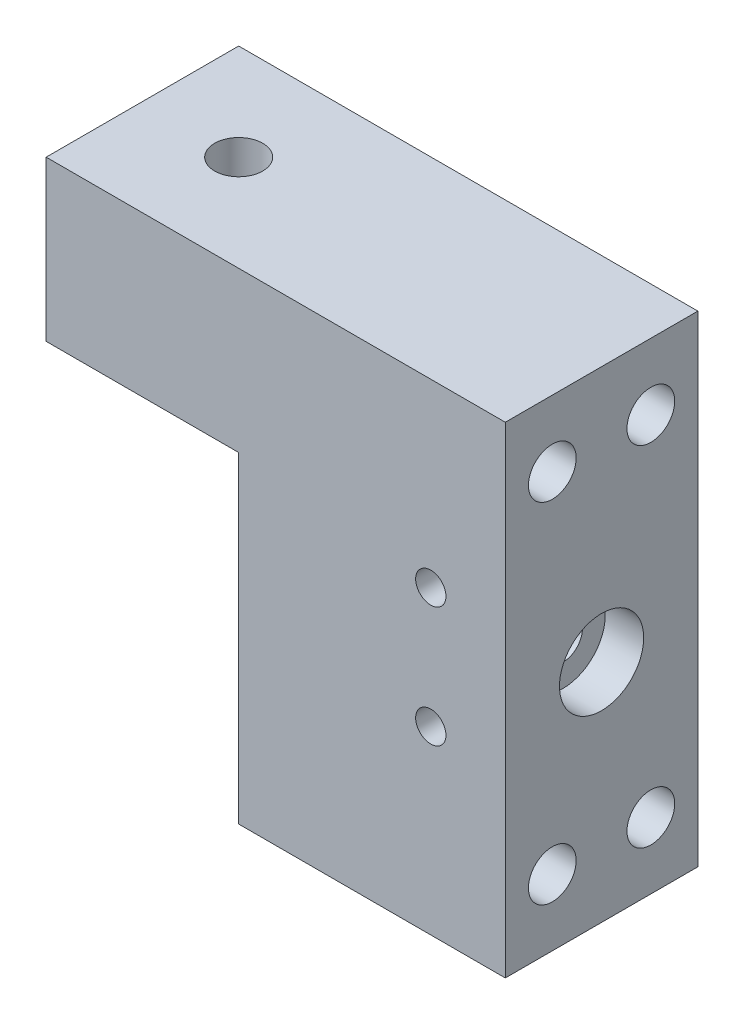
ISO-10303-21;
HEADER;
FILE_DESCRIPTION(('STEP AP214'),'2;1');
FILE_NAME('part.step','',(''),(''),'','','');
FILE_SCHEMA(('AUTOMOTIVE_DESIGN { 1 0 10303 214 1 1 1 1 }'));
ENDSEC;
DATA;
#1=APPLICATION_CONTEXT('core data for automotive mechanical design processes');
#2=APPLICATION_PROTOCOL_DEFINITION('international standard','automotive_design',2000,#1);
#3=PRODUCT_CONTEXT('',#1,'mechanical');
#4=PRODUCT('Part','Part','',(#3));
#5=PRODUCT_RELATED_PRODUCT_CATEGORY('part','',(#4));
#6=PRODUCT_DEFINITION_FORMATION('','',#4);
#7=PRODUCT_DEFINITION_CONTEXT('part definition',#1,'design');
#8=PRODUCT_DEFINITION('design','',#6,#7);
#9=PRODUCT_DEFINITION_SHAPE('','',#8);
#10=(LENGTH_UNIT() NAMED_UNIT(*) SI_UNIT(.MILLI.,.METRE.));
#11=(NAMED_UNIT(*) PLANE_ANGLE_UNIT() SI_UNIT($,.RADIAN.));
#12=(NAMED_UNIT(*) SI_UNIT($,.STERADIAN.) SOLID_ANGLE_UNIT());
#13=UNCERTAINTY_MEASURE_WITH_UNIT(LENGTH_MEASURE(1.E-05),#10,'distance_accuracy_value','');
#14=(GEOMETRIC_REPRESENTATION_CONTEXT(3) GLOBAL_UNCERTAINTY_ASSIGNED_CONTEXT((#13)) GLOBAL_UNIT_ASSIGNED_CONTEXT((#10,
#11,#12)) REPRESENTATION_CONTEXT('',''));
#15=CARTESIAN_POINT('',(0.,0.,0.));
#16=DIRECTION('',(0.,0.,1.));
#17=DIRECTION('',(1.,0.,0.));
#18=AXIS2_PLACEMENT_3D('',#15,#16,#17);
#19=CARTESIAN_POINT('',(-35.1759599997609,-372.311325805641,640.012630810973));
#20=DIRECTION('',(1.,2.16961551365428E-13,0.));
#21=DIRECTION('',(0.,0.,1.));
#22=AXIS2_PLACEMENT_3D('',#19,#20,#21);
#23=PLANE('',#22);
#24=CARTESIAN_POINT('',(-35.1759599997589,-381.861725805534,225.049350784979));
#25=DIRECTION('',(1.,2.16961551365428E-13,0.));
#26=DIRECTION('',(-2.16961551365428E-13,1.,0.));
#27=AXIS2_PLACEMENT_3D('',#24,#25,#26);
#28=CIRCLE('',#27,2.55270000000002);
#29=CARTESIAN_POINT('',(-35.1759599997595,-379.309025805534,225.049350784979));
#30=VERTEX_POINT('',#29);
#31=EDGE_CURVE('E118',#30,#30,#28,.T.);
#32=ORIENTED_EDGE('',*,*,#31,.T.);
#33=EDGE_LOOP('',(#32));
#34=FACE_BOUND('',#33,.T.);
#35=DIRECTION('',(0.,0.,1.));
#36=VECTOR('',#35,1.);
#37=CARTESIAN_POINT('',(-35.1759599998418,-369.161725805615,237.749350784974));
#38=LINE('',#37,#36);
#39=CARTESIAN_POINT('',(-35.1759599997617,-369.161725805615,212.349350784974));
#40=VERTEX_POINT('',#39);
#41=CARTESIAN_POINT('',(-35.1759599998418,-369.161725805615,237.749350784974));
#42=VERTEX_POINT('',#41);
#43=EDGE_CURVE('E49',#40,#42,#38,.T.);
#44=ORIENTED_EDGE('',*,*,#43,.F.);
#45=DIRECTION('',(2.16961551365428E-13,-1.,0.));
#46=VECTOR('',#45,1.);
#47=CARTESIAN_POINT('',(-35.1759599997662,-348.11172580558,212.349350784974));
#48=LINE('',#47,#46);
#49=CARTESIAN_POINT('',(-35.1759599997525,-411.611725805595,212.349350784974));
#50=VERTEX_POINT('',#49);
#51=EDGE_CURVE('E11',#40,#50,#48,.T.);
#52=ORIENTED_EDGE('',*,*,#51,.T.);
#53=DIRECTION('',(0.,0.,1.));
#54=VECTOR('',#53,1.);
#55=CARTESIAN_POINT('',(-35.1759599997525,-411.611725805595,212.349350784974));
#56=LINE('',#55,#54);
#57=CARTESIAN_POINT('',(-35.1759599997525,-411.611725805594,237.749350784974));
#58=VERTEX_POINT('',#57);
#59=EDGE_CURVE('E42',#50,#58,#56,.T.);
#60=ORIENTED_EDGE('',*,*,#59,.T.);
#61=DIRECTION('',(-2.16961551365428E-13,1.,0.));
#62=VECTOR('',#61,1.);
#63=CARTESIAN_POINT('',(-35.1759599997662,-348.11172580558,237.749350784974));
#64=LINE('',#63,#62);
#65=EDGE_CURVE('E172',#58,#42,#64,.T.);
#66=ORIENTED_EDGE('',*,*,#65,.T.);
#67=EDGE_LOOP('',(#44,#52,#60,#66));
#68=FACE_BOUND('',#67,.T.);
#69=ADVANCED_FACE('F33',(#34,#68),#23,.F.);
#70=CARTESIAN_POINT('',(-103.567553050368,-348.111725805595,212.349350784974));
#71=DIRECTION('',(0.,0.,-1.));
#72=DIRECTION('',(-1.,0.,0.));
#73=AXIS2_PLACEMENT_3D('',#70,#71,#72);
#74=PLANE('',#73);
#75=ORIENTED_EDGE('',*,*,#51,.F.);
#76=DIRECTION('',(1.,0.,0.));
#77=VECTOR('',#76,1.);
#78=CARTESIAN_POINT('',(-60.5759599998418,-369.161725805615,212.349350784974));
#79=LINE('',#78,#77);
#80=CARTESIAN_POINT('',(-60.5759599998418,-369.161725805615,212.349350784974));
#81=VERTEX_POINT('',#80);
#82=EDGE_CURVE('E168',#81,#40,#79,.T.);
#83=ORIENTED_EDGE('',*,*,#82,.F.);
#84=DIRECTION('',(0.,-1.,0.));
#85=VECTOR('',#84,1.);
#86=CARTESIAN_POINT('',(-60.5759599998418,-348.111725805595,212.349350784974));
#87=LINE('',#86,#85);
#88=CARTESIAN_POINT('',(-60.5759599998418,-348.111725805595,212.349350784974));
#89=VERTEX_POINT('',#88);
#90=EDGE_CURVE('E160',#89,#81,#87,.T.);
#91=ORIENTED_EDGE('',*,*,#90,.F.);
#92=DIRECTION('',(1.,0.,0.));
#93=VECTOR('',#92,1.);
#94=CARTESIAN_POINT('',(-103.567553050368,-348.111725805595,212.349350784974));
#95=LINE('',#94,#93);
#96=CARTESIAN_POINT('',(0.,-348.111725805595,212.349350784974));
#97=VERTEX_POINT('',#96);
#98=EDGE_CURVE('E37',#89,#97,#95,.T.);
#99=ORIENTED_EDGE('',*,*,#98,.T.);
#100=DIRECTION('',(0.,1.,0.));
#101=VECTOR('',#100,1.);
#102=CARTESIAN_POINT('',(0.,-348.111725805595,212.349350784974));
#103=LINE('',#102,#101);
#104=CARTESIAN_POINT('',(0.,-411.611725805595,212.349350784974));
#105=VERTEX_POINT('',#104);
#106=EDGE_CURVE('E171',#105,#97,#103,.T.);
#107=ORIENTED_EDGE('',*,*,#106,.F.);
#108=DIRECTION('',(1.,0.,0.));
#109=VECTOR('',#108,1.);
#110=CARTESIAN_POINT('',(-103.567553050368,-411.611725805595,212.349350784974));
#111=LINE('',#110,#109);
#112=EDGE_CURVE('E174',#50,#105,#111,.T.);
#113=ORIENTED_EDGE('',*,*,#112,.F.);
#114=EDGE_LOOP('',(#75,#83,#91,#99,#107,#113));
#115=FACE_BOUND('',#114,.T.);
#116=ADVANCED_FACE('F35',(#115),#74,.T.);
#117=CARTESIAN_POINT('',(-103.567553050368,-411.611725805595,212.349350784974));
#118=DIRECTION('',(0.,-1.,0.));
#119=DIRECTION('',(0.,0.,-1.));
#120=AXIS2_PLACEMENT_3D('',#117,#118,#119);
#121=PLANE('',#120);
#122=ORIENTED_EDGE('',*,*,#59,.F.);
#123=ORIENTED_EDGE('',*,*,#112,.T.);
#124=DIRECTION('',(0.,0.,-1.));
#125=VECTOR('',#124,1.);
#126=CARTESIAN_POINT('',(0.,-411.611725805595,212.349350784974));
#127=LINE('',#126,#125);
#128=CARTESIAN_POINT('',(0.,-411.611725805595,237.749350784974));
#129=VERTEX_POINT('',#128);
#130=EDGE_CURVE('E184',#129,#105,#127,.T.);
#131=ORIENTED_EDGE('',*,*,#130,.F.);
#132=DIRECTION('',(1.,0.,0.));
#133=VECTOR('',#132,1.);
#134=CARTESIAN_POINT('',(-103.567553050368,-411.611725805595,237.749350784974));
#135=LINE('',#134,#133);
#136=EDGE_CURVE('E188',#58,#129,#135,.T.);
#137=ORIENTED_EDGE('',*,*,#136,.F.);
#138=EDGE_LOOP('',(#122,#123,#131,#137));
#139=FACE_BOUND('',#138,.T.);
#140=ADVANCED_FACE('F205',(#139),#121,.T.);
#141=CARTESIAN_POINT('',(-103.567553050368,-348.111725805595,237.749350784974));
#142=DIRECTION('',(0.,0.,1.));
#143=DIRECTION('',(1.,0.,0.));
#144=AXIS2_PLACEMENT_3D('',#141,#142,#143);
#145=PLANE('',#144);
#146=CARTESIAN_POINT('',(-9.83125000953644,-371.924225805556,237.749350784974));
#147=DIRECTION('',(0.,0.,1.));
#148=DIRECTION('',(1.,0.,0.));
#149=AXIS2_PLACEMENT_3D('',#146,#147,#148);
#150=CIRCLE('',#149,2.);
#151=CARTESIAN_POINT('',(-7.83125000953644,-371.924225805556,237.749350784974));
#152=VERTEX_POINT('',#151);
#153=EDGE_CURVE('E112',#152,#152,#150,.T.);
#154=ORIENTED_EDGE('',*,*,#153,.F.);
#155=EDGE_LOOP('',(#154));
#156=FACE_BOUND('',#155,.T.);
#157=CARTESIAN_POINT('',(-9.83125000953644,-387.799225805556,237.749350784974));
#158=DIRECTION('',(0.,0.,1.));
#159=DIRECTION('',(1.,0.,0.));
#160=AXIS2_PLACEMENT_3D('',#157,#158,#159);
#161=CIRCLE('',#160,2.);
#162=CARTESIAN_POINT('',(-7.83125000953644,-387.799225805556,237.749350784974));
#163=VERTEX_POINT('',#162);
#164=EDGE_CURVE('E111',#163,#163,#161,.T.);
#165=ORIENTED_EDGE('',*,*,#164,.F.);
#166=EDGE_LOOP('',(#165));
#167=FACE_BOUND('',#166,.T.);
#168=ORIENTED_EDGE('',*,*,#65,.F.);
#169=ORIENTED_EDGE('',*,*,#136,.T.);
#170=DIRECTION('',(0.,-1.,0.));
#171=VECTOR('',#170,1.);
#172=CARTESIAN_POINT('',(0.,-348.111725805595,237.749350784974));
#173=LINE('',#172,#171);
#174=CARTESIAN_POINT('',(0.,-348.111725805595,237.749350784974));
#175=VERTEX_POINT('',#174);
#176=EDGE_CURVE('E181',#175,#129,#173,.T.);
#177=ORIENTED_EDGE('',*,*,#176,.F.);
#178=DIRECTION('',(1.,0.,0.));
#179=VECTOR('',#178,1.);
#180=CARTESIAN_POINT('',(-103.567553050368,-348.111725805595,237.749350784974));
#181=LINE('',#180,#179);
#182=CARTESIAN_POINT('',(-60.5759599998418,-348.111725805595,237.749350784974));
#183=VERTEX_POINT('',#182);
#184=EDGE_CURVE('E189',#183,#175,#181,.T.);
#185=ORIENTED_EDGE('',*,*,#184,.F.);
#186=DIRECTION('',(0.,1.,0.));
#187=VECTOR('',#186,1.);
#188=CARTESIAN_POINT('',(-60.5759599998418,-348.111725805595,237.749350784974));
#189=LINE('',#188,#187);
#190=CARTESIAN_POINT('',(-60.5759599998418,-369.161725805615,237.749350784974));
#191=VERTEX_POINT('',#190);
#192=EDGE_CURVE('E154',#191,#183,#189,.T.);
#193=ORIENTED_EDGE('',*,*,#192,.F.);
#194=DIRECTION('',(1.,0.,0.));
#195=VECTOR('',#194,1.);
#196=CARTESIAN_POINT('',(-60.5759599998418,-369.161725805615,237.749350784974));
#197=LINE('',#196,#195);
#198=EDGE_CURVE('E164',#191,#42,#197,.T.);
#199=ORIENTED_EDGE('',*,*,#198,.T.);
#200=EDGE_LOOP('',(#168,#169,#177,#185,#193,#199));
#201=FACE_BOUND('',#200,.T.);
#202=ADVANCED_FACE('F214',(#156,#167,#201),#145,.T.);
#203=CARTESIAN_POINT('',(-103.567553050368,-348.111725805595,212.349350784974));
#204=DIRECTION('',(0.,1.,0.));
#205=DIRECTION('',(0.,0.,1.));
#206=AXIS2_PLACEMENT_3D('',#203,#204,#205);
#207=PLANE('',#206);
#208=CARTESIAN_POINT('',(-47.8759599998418,-348.111725805595,225.049350784974));
#209=DIRECTION('',(0.,1.,0.));
#210=DIRECTION('',(0.,0.,1.));
#211=AXIS2_PLACEMENT_3D('',#208,#209,#210);
#212=CIRCLE('',#211,3.17499999999998);
#213=CARTESIAN_POINT('',(-47.8759599998418,-348.111725805595,228.224350784974));
#214=VERTEX_POINT('',#213);
#215=EDGE_CURVE('E148',#214,#214,#212,.T.);
#216=ORIENTED_EDGE('',*,*,#215,.F.);
#217=EDGE_LOOP('',(#216));
#218=FACE_BOUND('',#217,.T.);
#219=ORIENTED_EDGE('',*,*,#98,.F.);
#220=DIRECTION('',(0.,0.,-1.));
#221=VECTOR('',#220,1.);
#222=CARTESIAN_POINT('',(-60.5759599998418,-348.111725805595,237.749350784974));
#223=LINE('',#222,#221);
#224=EDGE_CURVE('E157',#183,#89,#223,.T.);
#225=ORIENTED_EDGE('',*,*,#224,.F.);
#226=ORIENTED_EDGE('',*,*,#184,.T.);
#227=DIRECTION('',(0.,0.,1.));
#228=VECTOR('',#227,1.);
#229=CARTESIAN_POINT('',(0.,-348.111725805595,212.349350784974));
#230=LINE('',#229,#228);
#231=EDGE_CURVE('E178',#97,#175,#230,.T.);
#232=ORIENTED_EDGE('',*,*,#231,.F.);
#233=EDGE_LOOP('',(#219,#225,#226,#232));
#234=FACE_BOUND('',#233,.T.);
#235=ADVANCED_FACE('F199',(#218,#234),#207,.T.);
#236=CARTESIAN_POINT('',(0.,0.,0.));
#237=DIRECTION('',(-1.,0.,0.));
#238=DIRECTION('',(0.,0.,1.));
#239=AXIS2_PLACEMENT_3D('',#236,#237,#238);
#240=PLANE('',#239);
#241=CARTESIAN_POINT('',(0.,-381.861725805534,225.049350784979));
#242=DIRECTION('',(1.,0.,0.));
#243=DIRECTION('',(0.,0.,-1.));
#244=AXIS2_PLACEMENT_3D('',#241,#242,#243);
#245=CIRCLE('',#244,5.55624999999998);
#246=CARTESIAN_POINT('',(0.,-381.861725805534,219.493100784979));
#247=VERTEX_POINT('',#246);
#248=EDGE_CURVE('E311',#247,#247,#245,.T.);
#249=ORIENTED_EDGE('',*,*,#248,.F.);
#250=EDGE_LOOP('',(#249));
#251=FACE_BOUND('',#250,.T.);
#252=CARTESIAN_POINT('',(0.,-356.861725805605,231.549350784934));
#253=DIRECTION('',(1.,0.,0.));
#254=DIRECTION('',(0.,0.,-1.));
#255=AXIS2_PLACEMENT_3D('',#252,#253,#254);
#256=CIRCLE('',#255,3.14999999999999);
#257=CARTESIAN_POINT('',(0.,-356.861725805605,228.399350784934));
#258=VERTEX_POINT('',#257);
#259=EDGE_CURVE('E124',#258,#258,#256,.T.);
#260=ORIENTED_EDGE('',*,*,#259,.F.);
#261=EDGE_LOOP('',(#260));
#262=FACE_BOUND('',#261,.T.);
#263=CARTESIAN_POINT('',(0.,-356.861725805605,218.549350784934));
#264=DIRECTION('',(1.,0.,0.));
#265=DIRECTION('',(0.,0.,-1.));
#266=AXIS2_PLACEMENT_3D('',#263,#264,#265);
#267=CIRCLE('',#266,3.14999999999999);
#268=CARTESIAN_POINT('',(0.,-356.861725805605,215.399350784934));
#269=VERTEX_POINT('',#268);
#270=EDGE_CURVE('E130',#269,#269,#267,.T.);
#271=ORIENTED_EDGE('',*,*,#270,.F.);
#272=EDGE_LOOP('',(#271));
#273=FACE_BOUND('',#272,.T.);
#274=CARTESIAN_POINT('',(0.,-402.861725805463,231.549350785085));
#275=DIRECTION('',(1.,0.,0.));
#276=DIRECTION('',(0.,0.,-1.));
#277=AXIS2_PLACEMENT_3D('',#274,#275,#276);
#278=CIRCLE('',#277,3.14999999999999);
#279=CARTESIAN_POINT('',(0.,-402.861725805463,228.399350785085));
#280=VERTEX_POINT('',#279);
#281=EDGE_CURVE('E136',#280,#280,#278,.T.);
#282=ORIENTED_EDGE('',*,*,#281,.F.);
#283=EDGE_LOOP('',(#282));
#284=FACE_BOUND('',#283,.T.);
#285=CARTESIAN_POINT('',(0.,-402.861725805464,218.549350785085));
#286=DIRECTION('',(1.,0.,0.));
#287=DIRECTION('',(0.,0.,-1.));
#288=AXIS2_PLACEMENT_3D('',#285,#286,#287);
#289=CIRCLE('',#288,3.14999999999999);
#290=CARTESIAN_POINT('',(0.,-402.861725805464,215.399350785085));
#291=VERTEX_POINT('',#290);
#292=EDGE_CURVE('E142',#291,#291,#289,.T.);
#293=ORIENTED_EDGE('',*,*,#292,.F.);
#294=EDGE_LOOP('',(#293));
#295=FACE_BOUND('',#294,.T.);
#296=ORIENTED_EDGE('',*,*,#106,.T.);
#297=ORIENTED_EDGE('',*,*,#231,.T.);
#298=ORIENTED_EDGE('',*,*,#176,.T.);
#299=ORIENTED_EDGE('',*,*,#130,.T.);
#300=EDGE_LOOP('',(#296,#297,#298,#299));
#301=FACE_BOUND('',#300,.T.);
#302=ADVANCED_FACE('F201',(#251,#262,#273,#284,#295,#301),#240,.F.);
#303=CARTESIAN_POINT('',(-60.5759599998418,-369.161725805615,237.749350784974));
#304=DIRECTION('',(0.,1.,0.));
#305=DIRECTION('',(0.,0.,1.));
#306=AXIS2_PLACEMENT_3D('',#303,#304,#305);
#307=PLANE('',#306);
#308=CARTESIAN_POINT('',(-47.8759599998418,-369.161725805615,225.049350784974));
#309=DIRECTION('',(0.,1.,0.));
#310=DIRECTION('',(0.,0.,1.));
#311=AXIS2_PLACEMENT_3D('',#308,#309,#310);
#312=CIRCLE('',#311,3.17499999999999);
#313=CARTESIAN_POINT('',(-47.8759599998418,-369.161725805615,228.224350784974));
#314=VERTEX_POINT('',#313);
#315=EDGE_CURVE('E151',#314,#314,#312,.T.);
#316=ORIENTED_EDGE('',*,*,#315,.T.);
#317=EDGE_LOOP('',(#316));
#318=FACE_BOUND('',#317,.T.);
#319=ORIENTED_EDGE('',*,*,#43,.T.);
#320=ORIENTED_EDGE('',*,*,#198,.F.);
#321=DIRECTION('',(0.,0.,1.));
#322=VECTOR('',#321,1.);
#323=CARTESIAN_POINT('',(-60.5759599998418,-369.161725805615,237.749350784974));
#324=LINE('',#323,#322);
#325=EDGE_CURVE('E162',#81,#191,#324,.T.);
#326=ORIENTED_EDGE('',*,*,#325,.F.);
#327=ORIENTED_EDGE('',*,*,#82,.T.);
#328=EDGE_LOOP('',(#319,#320,#326,#327));
#329=FACE_BOUND('',#328,.T.);
#330=ADVANCED_FACE('F208',(#318,#329),#307,.F.);
#331=CARTESIAN_POINT('',(-60.5759599998418,0.,0.));
#332=DIRECTION('',(1.,0.,0.));
#333=DIRECTION('',(0.,0.,-1.));
#334=AXIS2_PLACEMENT_3D('',#331,#332,#333);
#335=PLANE('',#334);
#336=ORIENTED_EDGE('',*,*,#192,.T.);
#337=ORIENTED_EDGE('',*,*,#224,.T.);
#338=ORIENTED_EDGE('',*,*,#90,.T.);
#339=ORIENTED_EDGE('',*,*,#325,.T.);
#340=EDGE_LOOP('',(#336,#337,#338,#339));
#341=FACE_BOUND('',#340,.T.);
#342=ADVANCED_FACE('F212',(#341),#335,.F.);
#343=CARTESIAN_POINT('',(-47.8759599998418,-348.111725805595,225.049350784974));
#344=DIRECTION('',(0.,1.,0.));
#345=DIRECTION('',(0.,0.,1.));
#346=AXIS2_PLACEMENT_3D('',#343,#344,#345);
#347=CYLINDRICAL_SURFACE('',#346,3.17499999999999);
#348=ORIENTED_EDGE('',*,*,#215,.T.);
#349=EDGE_LOOP('',(#348));
#350=FACE_BOUND('',#349,.T.);
#351=ORIENTED_EDGE('',*,*,#315,.F.);
#352=EDGE_LOOP('',(#351));
#353=FACE_BOUND('',#352,.T.);
#354=ADVANCED_FACE('F238',(#350,#353),#347,.F.);
#355=CARTESIAN_POINT('',(-8.9916,-402.861725805464,218.549350785085));
#356=DIRECTION('',(1.,0.,0.));
#357=DIRECTION('',(0.,0.,-1.));
#358=AXIS2_PLACEMENT_3D('',#355,#356,#357);
#359=CONICAL_SURFACE('',#358,3.14999999999999,1.02974425867665);
#360=CARTESIAN_POINT('',(-10.8843109499368,-402.861725805464,218.549350785085));
#361=VERTEX_POINT('',#360);
#362=VERTEX_LOOP('',#361);
#363=FACE_BOUND('',#362,.T.);
#364=CARTESIAN_POINT('',(-8.9916,-402.861725805464,218.549350785085));
#365=DIRECTION('',(1.,0.,0.));
#366=DIRECTION('',(0.,0.,-1.));
#367=AXIS2_PLACEMENT_3D('',#364,#365,#366);
#368=CIRCLE('',#367,3.14999999999999);
#369=CARTESIAN_POINT('',(-8.9916,-402.861725805464,215.399350785085));
#370=VERTEX_POINT('',#369);
#371=EDGE_CURVE('E145',#370,#370,#368,.T.);
#372=ORIENTED_EDGE('',*,*,#371,.T.);
#373=EDGE_LOOP('',(#372));
#374=FACE_BOUND('',#373,.T.);
#375=ADVANCED_FACE('F241',(#363,#374),#359,.F.);
#376=CARTESIAN_POINT('',(0.,-402.861725805464,218.549350785085));
#377=DIRECTION('',(1.,0.,0.));
#378=DIRECTION('',(0.,0.,-1.));
#379=AXIS2_PLACEMENT_3D('',#376,#377,#378);
#380=CYLINDRICAL_SURFACE('',#379,3.14999999999999);
#381=ORIENTED_EDGE('',*,*,#371,.F.);
#382=EDGE_LOOP('',(#381));
#383=FACE_BOUND('',#382,.T.);
#384=ORIENTED_EDGE('',*,*,#292,.T.);
#385=EDGE_LOOP('',(#384));
#386=FACE_BOUND('',#385,.T.);
#387=ADVANCED_FACE('F254',(#383,#386),#380,.F.);
#388=CARTESIAN_POINT('',(-8.9916,-402.861725805463,231.549350785085));
#389=DIRECTION('',(1.,0.,0.));
#390=DIRECTION('',(0.,0.,-1.));
#391=AXIS2_PLACEMENT_3D('',#388,#389,#390);
#392=CONICAL_SURFACE('',#391,3.14999999999999,1.02974425867665);
#393=CARTESIAN_POINT('',(-10.8843109499368,-402.861725805463,231.549350785085));
#394=VERTEX_POINT('',#393);
#395=VERTEX_LOOP('',#394);
#396=FACE_BOUND('',#395,.T.);
#397=CARTESIAN_POINT('',(-8.9916,-402.861725805463,231.549350785085));
#398=DIRECTION('',(1.,0.,0.));
#399=DIRECTION('',(0.,0.,-1.));
#400=AXIS2_PLACEMENT_3D('',#397,#398,#399);
#401=CIRCLE('',#400,3.14999999999999);
#402=CARTESIAN_POINT('',(-8.9916,-402.861725805463,228.399350785085));
#403=VERTEX_POINT('',#402);
#404=EDGE_CURVE('E139',#403,#403,#401,.T.);
#405=ORIENTED_EDGE('',*,*,#404,.T.);
#406=EDGE_LOOP('',(#405));
#407=FACE_BOUND('',#406,.T.);
#408=ADVANCED_FACE('F258',(#396,#407),#392,.F.);
#409=CARTESIAN_POINT('',(0.,-402.861725805463,231.549350785085));
#410=DIRECTION('',(1.,0.,0.));
#411=DIRECTION('',(0.,0.,-1.));
#412=AXIS2_PLACEMENT_3D('',#409,#410,#411);
#413=CYLINDRICAL_SURFACE('',#412,3.14999999999999);
#414=ORIENTED_EDGE('',*,*,#404,.F.);
#415=EDGE_LOOP('',(#414));
#416=FACE_BOUND('',#415,.T.);
#417=ORIENTED_EDGE('',*,*,#281,.T.);
#418=EDGE_LOOP('',(#417));
#419=FACE_BOUND('',#418,.T.);
#420=ADVANCED_FACE('F262',(#416,#419),#413,.F.);
#421=CARTESIAN_POINT('',(-8.9916,-356.861725805605,218.549350784934));
#422=DIRECTION('',(1.,0.,0.));
#423=DIRECTION('',(0.,0.,-1.));
#424=AXIS2_PLACEMENT_3D('',#421,#422,#423);
#425=CONICAL_SURFACE('',#424,3.14999999999999,1.02974425867665);
#426=CARTESIAN_POINT('',(-10.8843109499368,-356.861725805605,218.549350784934));
#427=VERTEX_POINT('',#426);
#428=VERTEX_LOOP('',#427);
#429=FACE_BOUND('',#428,.T.);
#430=CARTESIAN_POINT('',(-8.9916,-356.861725805605,218.549350784934));
#431=DIRECTION('',(1.,0.,0.));
#432=DIRECTION('',(0.,0.,-1.));
#433=AXIS2_PLACEMENT_3D('',#430,#431,#432);
#434=CIRCLE('',#433,3.14999999999999);
#435=CARTESIAN_POINT('',(-8.9916,-356.861725805605,215.399350784934));
#436=VERTEX_POINT('',#435);
#437=EDGE_CURVE('E133',#436,#436,#434,.T.);
#438=ORIENTED_EDGE('',*,*,#437,.T.);
#439=EDGE_LOOP('',(#438));
#440=FACE_BOUND('',#439,.T.);
#441=ADVANCED_FACE('F266',(#429,#440),#425,.F.);
#442=CARTESIAN_POINT('',(0.,-356.861725805605,218.549350784934));
#443=DIRECTION('',(1.,0.,0.));
#444=DIRECTION('',(0.,0.,-1.));
#445=AXIS2_PLACEMENT_3D('',#442,#443,#444);
#446=CYLINDRICAL_SURFACE('',#445,3.14999999999999);
#447=ORIENTED_EDGE('',*,*,#437,.F.);
#448=EDGE_LOOP('',(#447));
#449=FACE_BOUND('',#448,.T.);
#450=ORIENTED_EDGE('',*,*,#270,.T.);
#451=EDGE_LOOP('',(#450));
#452=FACE_BOUND('',#451,.T.);
#453=ADVANCED_FACE('F270',(#449,#452),#446,.F.);
#454=CARTESIAN_POINT('',(-8.9916,-356.861725805605,231.549350784934));
#455=DIRECTION('',(1.,0.,0.));
#456=DIRECTION('',(0.,0.,-1.));
#457=AXIS2_PLACEMENT_3D('',#454,#455,#456);
#458=CONICAL_SURFACE('',#457,3.14999999999999,1.02974425867665);
#459=CARTESIAN_POINT('',(-10.8843109499368,-356.861725805605,231.549350784934));
#460=VERTEX_POINT('',#459);
#461=VERTEX_LOOP('',#460);
#462=FACE_BOUND('',#461,.T.);
#463=CARTESIAN_POINT('',(-8.9916,-356.861725805605,231.549350784934));
#464=DIRECTION('',(1.,0.,0.));
#465=DIRECTION('',(0.,0.,-1.));
#466=AXIS2_PLACEMENT_3D('',#463,#464,#465);
#467=CIRCLE('',#466,3.14999999999999);
#468=CARTESIAN_POINT('',(-8.9916,-356.861725805605,228.399350784934));
#469=VERTEX_POINT('',#468);
#470=EDGE_CURVE('E127',#469,#469,#467,.T.);
#471=ORIENTED_EDGE('',*,*,#470,.T.);
#472=EDGE_LOOP('',(#471));
#473=FACE_BOUND('',#472,.T.);
#474=ADVANCED_FACE('F274',(#462,#473),#458,.F.);
#475=CARTESIAN_POINT('',(0.,-356.861725805605,231.549350784934));
#476=DIRECTION('',(1.,0.,0.));
#477=DIRECTION('',(0.,0.,-1.));
#478=AXIS2_PLACEMENT_3D('',#475,#476,#477);
#479=CYLINDRICAL_SURFACE('',#478,3.14999999999999);
#480=ORIENTED_EDGE('',*,*,#470,.F.);
#481=EDGE_LOOP('',(#480));
#482=FACE_BOUND('',#481,.T.);
#483=ORIENTED_EDGE('',*,*,#259,.T.);
#484=EDGE_LOOP('',(#483));
#485=FACE_BOUND('',#484,.T.);
#486=ADVANCED_FACE('F278',(#482,#485),#479,.F.);
#487=CARTESIAN_POINT('',(-9.83125000953644,-387.799225805556,222.509350784974));
#488=DIRECTION('',(0.,0.,1.));
#489=DIRECTION('',(1.,0.,0.));
#490=AXIS2_PLACEMENT_3D('',#487,#488,#489);
#491=CONICAL_SURFACE('',#490,2.,1.02974425867665);
#492=CARTESIAN_POINT('',(-9.83125000953644,-387.799225805556,221.307629546919));
#493=VERTEX_POINT('',#492);
#494=VERTEX_LOOP('',#493);
#495=FACE_BOUND('',#494,.T.);
#496=CARTESIAN_POINT('',(-9.83125000953644,-387.799225805556,222.509350784974));
#497=DIRECTION('',(0.,0.,1.));
#498=DIRECTION('',(1.,0.,0.));
#499=AXIS2_PLACEMENT_3D('',#496,#497,#498);
#500=CIRCLE('',#499,2.);
#501=CARTESIAN_POINT('',(-7.83125000953644,-387.799225805556,222.509350784974));
#502=VERTEX_POINT('',#501);
#503=EDGE_CURVE('E115',#502,#502,#500,.T.);
#504=ORIENTED_EDGE('',*,*,#503,.T.);
#505=EDGE_LOOP('',(#504));
#506=FACE_BOUND('',#505,.T.);
#507=ADVANCED_FACE('F282',(#495,#506),#491,.F.);
#508=CARTESIAN_POINT('',(-9.83125000953644,-387.799225805556,237.749350784974));
#509=DIRECTION('',(0.,0.,1.));
#510=DIRECTION('',(1.,0.,0.));
#511=AXIS2_PLACEMENT_3D('',#508,#509,#510);
#512=CYLINDRICAL_SURFACE('',#511,2.);
#513=ORIENTED_EDGE('',*,*,#503,.F.);
#514=EDGE_LOOP('',(#513));
#515=FACE_BOUND('',#514,.T.);
#516=ORIENTED_EDGE('',*,*,#164,.T.);
#517=EDGE_LOOP('',(#516));
#518=FACE_BOUND('',#517,.T.);
#519=ADVANCED_FACE('F105',(#515,#518),#512,.F.);
#520=CARTESIAN_POINT('',(-9.83125000953644,-371.924225805556,222.509350784974));
#521=DIRECTION('',(0.,0.,1.));
#522=DIRECTION('',(1.,0.,0.));
#523=AXIS2_PLACEMENT_3D('',#520,#521,#522);
#524=CONICAL_SURFACE('',#523,2.,1.02974425867665);
#525=CARTESIAN_POINT('',(-9.83125000953644,-371.924225805556,221.307629546919));
#526=VERTEX_POINT('',#525);
#527=VERTEX_LOOP('',#526);
#528=FACE_BOUND('',#527,.T.);
#529=CARTESIAN_POINT('',(-9.83125000953644,-371.924225805556,222.509350784974));
#530=DIRECTION('',(0.,0.,1.));
#531=DIRECTION('',(1.,0.,0.));
#532=AXIS2_PLACEMENT_3D('',#529,#530,#531);
#533=CIRCLE('',#532,2.);
#534=CARTESIAN_POINT('',(-7.83125000953644,-371.924225805556,222.509350784974));
#535=VERTEX_POINT('',#534);
#536=EDGE_CURVE('E109',#535,#535,#533,.T.);
#537=ORIENTED_EDGE('',*,*,#536,.T.);
#538=EDGE_LOOP('',(#537));
#539=FACE_BOUND('',#538,.T.);
#540=ADVANCED_FACE('F101',(#528,#539),#524,.F.);
#541=CARTESIAN_POINT('',(-9.83125000953644,-371.924225805556,237.749350784974));
#542=DIRECTION('',(0.,0.,1.));
#543=DIRECTION('',(1.,0.,0.));
#544=AXIS2_PLACEMENT_3D('',#541,#542,#543);
#545=CYLINDRICAL_SURFACE('',#544,2.);
#546=ORIENTED_EDGE('',*,*,#536,.F.);
#547=EDGE_LOOP('',(#546));
#548=FACE_BOUND('',#547,.T.);
#549=ORIENTED_EDGE('',*,*,#153,.T.);
#550=EDGE_LOOP('',(#549));
#551=FACE_BOUND('',#550,.T.);
#552=ADVANCED_FACE('F104',(#548,#551),#545,.F.);
#553=CARTESIAN_POINT('',(0.,-381.861725805534,225.049350784979));
#554=DIRECTION('',(1.,0.,0.));
#555=DIRECTION('',(0.,0.,-1.));
#556=AXIS2_PLACEMENT_3D('',#553,#554,#555);
#557=CYLINDRICAL_SURFACE('',#556,2.55270000000002);
#558=ORIENTED_EDGE('',*,*,#31,.F.);
#559=EDGE_LOOP('',(#558));
#560=FACE_BOUND('',#559,.T.);
#561=CARTESIAN_POINT('',(-5.08,-381.861725805534,225.049350784979));
#562=DIRECTION('',(1.,0.,0.));
#563=DIRECTION('',(0.,0.,-1.));
#564=AXIS2_PLACEMENT_3D('',#561,#562,#563);
#565=CIRCLE('',#564,2.55270000000002);
#566=CARTESIAN_POINT('',(-5.08,-381.861725805534,222.496650784979));
#567=VERTEX_POINT('',#566);
#568=EDGE_CURVE('E313',#567,#567,#565,.T.);
#569=ORIENTED_EDGE('',*,*,#568,.T.);
#570=EDGE_LOOP('',(#569));
#571=FACE_BOUND('',#570,.T.);
#572=ADVANCED_FACE('F292',(#560,#571),#557,.F.);
#573=CARTESIAN_POINT('',(-5.08,-379.309025805534,225.049350784979));
#574=DIRECTION('',(-1.,0.,0.));
#575=DIRECTION('',(0.,0.,1.));
#576=AXIS2_PLACEMENT_3D('',#573,#574,#575);
#577=PLANE('',#576);
#578=ORIENTED_EDGE('',*,*,#568,.F.);
#579=EDGE_LOOP('',(#578));
#580=FACE_BOUND('',#579,.T.);
#581=CARTESIAN_POINT('',(-5.08,-381.861725805534,225.049350784979));
#582=DIRECTION('',(1.,0.,0.));
#583=DIRECTION('',(0.,0.,-1.));
#584=AXIS2_PLACEMENT_3D('',#581,#582,#583);
#585=CIRCLE('',#584,5.55624999999998);
#586=CARTESIAN_POINT('',(-5.08,-381.861725805534,219.493100784979));
#587=VERTEX_POINT('',#586);
#588=EDGE_CURVE('E308',#587,#587,#585,.T.);
#589=ORIENTED_EDGE('',*,*,#588,.T.);
#590=EDGE_LOOP('',(#589));
#591=FACE_BOUND('',#590,.T.);
#592=ADVANCED_FACE('F295',(#580,#591),#577,.F.);
#593=CARTESIAN_POINT('',(0.,-381.861725805534,225.049350784979));
#594=DIRECTION('',(1.,0.,0.));
#595=DIRECTION('',(0.,0.,-1.));
#596=AXIS2_PLACEMENT_3D('',#593,#594,#595);
#597=CYLINDRICAL_SURFACE('',#596,5.55624999999998);
#598=ORIENTED_EDGE('',*,*,#588,.F.);
#599=EDGE_LOOP('',(#598));
#600=FACE_BOUND('',#599,.T.);
#601=ORIENTED_EDGE('',*,*,#248,.T.);
#602=EDGE_LOOP('',(#601));
#603=FACE_BOUND('',#602,.T.);
#604=ADVANCED_FACE('F299',(#600,#603),#597,.F.);
#605=CLOSED_SHELL('',(#69,#116,#140,#202,#235,#302,#330,#342,#354,#375,#387,#408,#420,#441,#453,
#474,#486,#507,#519,#540,#552,#572,#592,#604));
#606=MANIFOLD_SOLID_BREP('B2',#605);
#607=ADVANCED_BREP_SHAPE_REPRESENTATION('',(#18,#606),#14);
#608=SHAPE_DEFINITION_REPRESENTATION(#9,#607);
ENDSEC;
END-ISO-10303-21;
